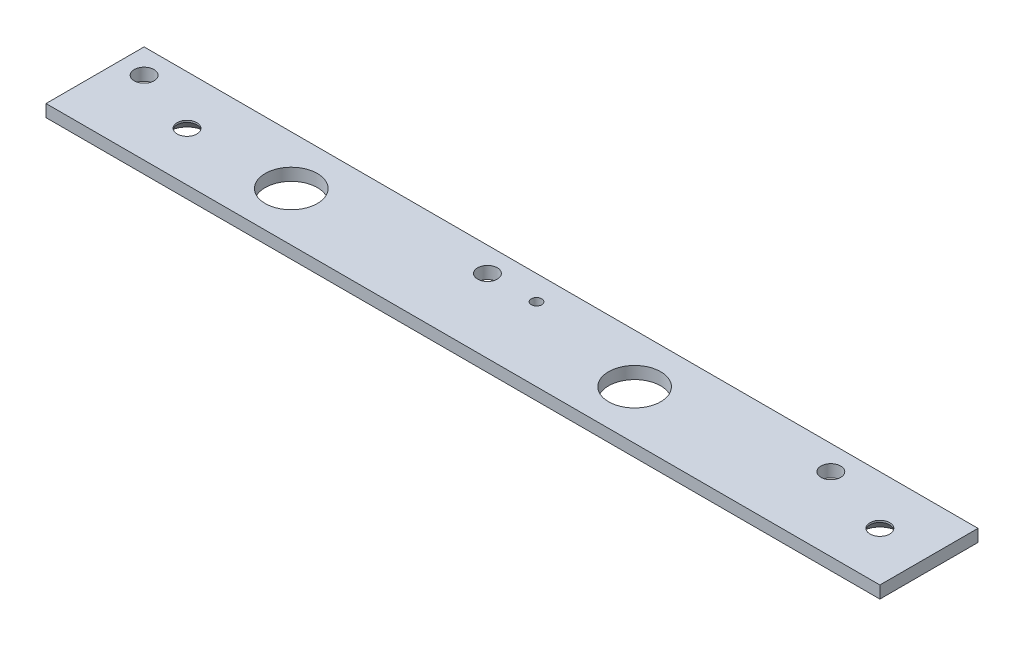
ISO-10303-21;
HEADER;
FILE_DESCRIPTION(('STEP AP214'),'2;1');
FILE_NAME('part.step','',(''),(''),'','','');
FILE_SCHEMA(('AUTOMOTIVE_DESIGN { 1 0 10303 214 1 1 1 1 }'));
ENDSEC;
DATA;
#1=APPLICATION_CONTEXT('core data for automotive mechanical design processes');
#2=APPLICATION_PROTOCOL_DEFINITION('international standard','automotive_design',2000,#1);
#3=PRODUCT_CONTEXT('',#1,'mechanical');
#4=PRODUCT('Part','Part','',(#3));
#5=PRODUCT_RELATED_PRODUCT_CATEGORY('part','',(#4));
#6=PRODUCT_DEFINITION_FORMATION('','',#4);
#7=PRODUCT_DEFINITION_CONTEXT('part definition',#1,'design');
#8=PRODUCT_DEFINITION('design','',#6,#7);
#9=PRODUCT_DEFINITION_SHAPE('','',#8);
#10=(LENGTH_UNIT() NAMED_UNIT(*) SI_UNIT(.MILLI.,.METRE.));
#11=(NAMED_UNIT(*) PLANE_ANGLE_UNIT() SI_UNIT($,.RADIAN.));
#12=(NAMED_UNIT(*) SI_UNIT($,.STERADIAN.) SOLID_ANGLE_UNIT());
#13=UNCERTAINTY_MEASURE_WITH_UNIT(LENGTH_MEASURE(1.E-05),#10,'distance_accuracy_value','');
#14=(GEOMETRIC_REPRESENTATION_CONTEXT(3) GLOBAL_UNCERTAINTY_ASSIGNED_CONTEXT((#13)) GLOBAL_UNIT_ASSIGNED_CONTEXT((#10,
#11,#12)) REPRESENTATION_CONTEXT('',''));
#15=CARTESIAN_POINT('',(0.,0.,0.));
#16=DIRECTION('',(0.,0.,1.));
#17=DIRECTION('',(1.,0.,0.));
#18=AXIS2_PLACEMENT_3D('',#15,#16,#17);
#19=CARTESIAN_POINT('',(107.95,1.5875,-12.7));
#20=DIRECTION('',(0.,0.,1.));
#21=DIRECTION('',(1.,0.,0.));
#22=AXIS2_PLACEMENT_3D('',#19,#20,#21);
#23=PLANE('',#22);
#24=DIRECTION('',(0.,1.,0.));
#25=VECTOR('',#24,1.);
#26=CARTESIAN_POINT('',(-107.95,1.5875,-12.7));
#27=LINE('',#26,#25);
#28=CARTESIAN_POINT('',(-107.95,-1.5875,-12.7));
#29=VERTEX_POINT('',#28);
#30=CARTESIAN_POINT('',(-107.95,1.5875,-12.7));
#31=VERTEX_POINT('',#30);
#32=EDGE_CURVE('E109',#29,#31,#27,.T.);
#33=ORIENTED_EDGE('',*,*,#32,.T.);
#34=DIRECTION('',(-1.,0.,0.));
#35=VECTOR('',#34,1.);
#36=CARTESIAN_POINT('',(107.95,1.5875,-12.7));
#37=LINE('',#36,#35);
#38=CARTESIAN_POINT('',(107.95,1.5875,-12.7));
#39=VERTEX_POINT('',#38);
#40=EDGE_CURVE('E13',#39,#31,#37,.T.);
#41=ORIENTED_EDGE('',*,*,#40,.F.);
#42=DIRECTION('',(0.,1.,0.));
#43=VECTOR('',#42,1.);
#44=CARTESIAN_POINT('',(107.95,1.5875,-12.7));
#45=LINE('',#44,#43);
#46=CARTESIAN_POINT('',(107.95,-1.5875,-12.7));
#47=VERTEX_POINT('',#46);
#48=EDGE_CURVE('E97',#47,#39,#45,.T.);
#49=ORIENTED_EDGE('',*,*,#48,.F.);
#50=DIRECTION('',(-1.,0.,0.));
#51=VECTOR('',#50,1.);
#52=CARTESIAN_POINT('',(107.95,-1.5875,-12.7));
#53=LINE('',#52,#51);
#54=EDGE_CURVE('E105',#47,#29,#53,.T.);
#55=ORIENTED_EDGE('',*,*,#54,.T.);
#56=EDGE_LOOP('',(#33,#41,#49,#55));
#57=FACE_BOUND('',#56,.T.);
#58=ADVANCED_FACE('F46',(#57),#23,.F.);
#59=CARTESIAN_POINT('',(107.95,1.5875,12.7));
#60=DIRECTION('',(0.,-1.,0.));
#61=DIRECTION('',(0.,0.,-1.));
#62=AXIS2_PLACEMENT_3D('',#59,#60,#61);
#63=PLANE('',#62);
#64=CARTESIAN_POINT('',(95.2499999999999,1.5875,1.17961196366423E-13));
#65=DIRECTION('',(0.,-1.,0.));
#66=DIRECTION('',(0.,0.,-1.));
#67=AXIS2_PLACEMENT_3D('',#64,#65,#66);
#68=CIRCLE('',#67,2.55269999999999);
#69=CARTESIAN_POINT('',(95.2499999999999,1.5875,-2.55269999999987));
#70=VERTEX_POINT('',#69);
#71=EDGE_CURVE('E167',#70,#70,#68,.T.);
#72=ORIENTED_EDGE('',*,*,#71,.T.);
#73=EDGE_LOOP('',(#72));
#74=FACE_BOUND('',#73,.T.);
#75=CARTESIAN_POINT('',(-84.1375,1.5875,1.04083408558608E-13));
#76=DIRECTION('',(0.,-1.,0.));
#77=DIRECTION('',(0.,0.,-1.));
#78=AXIS2_PLACEMENT_3D('',#75,#76,#77);
#79=CIRCLE('',#78,2.55269999999999);
#80=CARTESIAN_POINT('',(-84.1375,1.5875,-2.55269999999989));
#81=VERTEX_POINT('',#80);
#82=EDGE_CURVE('E158',#81,#81,#79,.T.);
#83=ORIENTED_EDGE('',*,*,#82,.T.);
#84=EDGE_LOOP('',(#83));
#85=FACE_BOUND('',#84,.T.);
#86=CARTESIAN_POINT('',(0.,1.5875,-6.35));
#87=DIRECTION('',(0.,1.,0.));
#88=DIRECTION('',(0.,0.,1.));
#89=AXIS2_PLACEMENT_3D('',#86,#87,#88);
#90=CIRCLE('',#89,1.35254999999999);
#91=CARTESIAN_POINT('',(0.,1.5875,-4.99745000000001));
#92=VERTEX_POINT('',#91);
#93=EDGE_CURVE('E155',#92,#92,#90,.T.);
#94=ORIENTED_EDGE('',*,*,#93,.F.);
#95=EDGE_LOOP('',(#94));
#96=FACE_BOUND('',#95,.T.);
#97=CARTESIAN_POINT('',(-57.15,1.5875,0.));
#98=DIRECTION('',(0.,1.,0.));
#99=DIRECTION('',(0.,0.,1.));
#100=AXIS2_PLACEMENT_3D('',#97,#98,#99);
#101=CIRCLE('',#100,6.74624);
#102=CARTESIAN_POINT('',(-57.15,1.5875,6.74624));
#103=VERTEX_POINT('',#102);
#104=EDGE_CURVE('E149',#103,#103,#101,.T.);
#105=ORIENTED_EDGE('',*,*,#104,.F.);
#106=EDGE_LOOP('',(#105));
#107=FACE_BOUND('',#106,.T.);
#108=CARTESIAN_POINT('',(31.75,1.5875,0.));
#109=DIRECTION('',(0.,1.,0.));
#110=DIRECTION('',(0.,0.,1.));
#111=AXIS2_PLACEMENT_3D('',#108,#109,#110);
#112=CIRCLE('',#111,6.74624);
#113=CARTESIAN_POINT('',(31.75,1.5875,6.74624));
#114=VERTEX_POINT('',#113);
#115=EDGE_CURVE('E143',#114,#114,#112,.T.);
#116=ORIENTED_EDGE('',*,*,#115,.F.);
#117=EDGE_LOOP('',(#116));
#118=FACE_BOUND('',#117,.T.);
#119=CARTESIAN_POINT('',(-101.6,1.5875,-6.35));
#120=DIRECTION('',(0.,1.,0.));
#121=DIRECTION('',(0.,0.,1.));
#122=AXIS2_PLACEMENT_3D('',#119,#120,#121);
#123=CIRCLE('',#122,2.55269999999999);
#124=CARTESIAN_POINT('',(-101.6,1.5875,-3.79730000000001));
#125=VERTEX_POINT('',#124);
#126=EDGE_CURVE('E137',#125,#125,#123,.T.);
#127=ORIENTED_EDGE('',*,*,#126,.F.);
#128=EDGE_LOOP('',(#127));
#129=FACE_BOUND('',#128,.T.);
#130=CARTESIAN_POINT('',(-12.7,1.5875,-6.35));
#131=DIRECTION('',(0.,1.,0.));
#132=DIRECTION('',(0.,0.,1.));
#133=AXIS2_PLACEMENT_3D('',#130,#131,#132);
#134=CIRCLE('',#133,2.55269999999999);
#135=CARTESIAN_POINT('',(-12.7,1.5875,-3.79730000000001));
#136=VERTEX_POINT('',#135);
#137=EDGE_CURVE('E131',#136,#136,#134,.T.);
#138=ORIENTED_EDGE('',*,*,#137,.F.);
#139=EDGE_LOOP('',(#138));
#140=FACE_BOUND('',#139,.T.);
#141=CARTESIAN_POINT('',(76.2,1.5875,-6.35));
#142=DIRECTION('',(0.,1.,0.));
#143=DIRECTION('',(0.,0.,1.));
#144=AXIS2_PLACEMENT_3D('',#141,#142,#143);
#145=CIRCLE('',#144,2.55269999999999);
#146=CARTESIAN_POINT('',(76.2,1.5875,-3.79730000000001));
#147=VERTEX_POINT('',#146);
#148=EDGE_CURVE('E125',#147,#147,#145,.T.);
#149=ORIENTED_EDGE('',*,*,#148,.F.);
#150=EDGE_LOOP('',(#149));
#151=FACE_BOUND('',#150,.T.);
#152=DIRECTION('',(0.,0.,1.));
#153=VECTOR('',#152,1.);
#154=CARTESIAN_POINT('',(-107.95,1.5875,12.7));
#155=LINE('',#154,#153);
#156=CARTESIAN_POINT('',(-107.95,1.5875,12.7));
#157=VERTEX_POINT('',#156);
#158=EDGE_CURVE('E101',#31,#157,#155,.T.);
#159=ORIENTED_EDGE('',*,*,#158,.T.);
#160=DIRECTION('',(-1.,0.,0.));
#161=VECTOR('',#160,1.);
#162=CARTESIAN_POINT('',(107.95,1.5875,12.7));
#163=LINE('',#162,#161);
#164=CARTESIAN_POINT('',(107.95,1.5875,12.7));
#165=VERTEX_POINT('',#164);
#166=EDGE_CURVE('E54',#165,#157,#163,.T.);
#167=ORIENTED_EDGE('',*,*,#166,.F.);
#168=DIRECTION('',(0.,0.,1.));
#169=VECTOR('',#168,1.);
#170=CARTESIAN_POINT('',(107.95,1.5875,12.7));
#171=LINE('',#170,#169);
#172=EDGE_CURVE('E92',#39,#165,#171,.T.);
#173=ORIENTED_EDGE('',*,*,#172,.F.);
#174=ORIENTED_EDGE('',*,*,#40,.T.);
#175=EDGE_LOOP('',(#159,#167,#173,#174));
#176=FACE_BOUND('',#175,.T.);
#177=ADVANCED_FACE('F100',(#74,#85,#96,#107,#118,#129,#140,#151,#176),#63,.F.);
#178=CARTESIAN_POINT('',(107.95,1.5875,12.7));
#179=DIRECTION('',(0.,0.,-1.));
#180=DIRECTION('',(0.,1.,0.));
#181=AXIS2_PLACEMENT_3D('',#178,#179,#180);
#182=PLANE('',#181);
#183=DIRECTION('',(0.,-1.,0.));
#184=VECTOR('',#183,1.);
#185=CARTESIAN_POINT('',(-107.95,1.5875,12.7));
#186=LINE('',#185,#184);
#187=CARTESIAN_POINT('',(-107.95,-1.5875,12.7));
#188=VERTEX_POINT('',#187);
#189=EDGE_CURVE('E79',#157,#188,#186,.T.);
#190=ORIENTED_EDGE('',*,*,#189,.T.);
#191=DIRECTION('',(-1.,0.,0.));
#192=VECTOR('',#191,1.);
#193=CARTESIAN_POINT('',(107.95,-1.5875,12.7));
#194=LINE('',#193,#192);
#195=CARTESIAN_POINT('',(107.95,-1.5875,12.7));
#196=VERTEX_POINT('',#195);
#197=EDGE_CURVE('E102',#196,#188,#194,.T.);
#198=ORIENTED_EDGE('',*,*,#197,.F.);
#199=DIRECTION('',(0.,-1.,0.));
#200=VECTOR('',#199,1.);
#201=CARTESIAN_POINT('',(107.95,1.5875,12.7));
#202=LINE('',#201,#200);
#203=EDGE_CURVE('E95',#165,#196,#202,.T.);
#204=ORIENTED_EDGE('',*,*,#203,.F.);
#205=ORIENTED_EDGE('',*,*,#166,.T.);
#206=EDGE_LOOP('',(#190,#198,#204,#205));
#207=FACE_BOUND('',#206,.T.);
#208=ADVANCED_FACE('F103',(#207),#182,.F.);
#209=CARTESIAN_POINT('',(107.95,-1.5875,12.7));
#210=DIRECTION('',(0.,1.,0.));
#211=DIRECTION('',(0.,0.,1.));
#212=AXIS2_PLACEMENT_3D('',#209,#210,#211);
#213=PLANE('',#212);
#214=CARTESIAN_POINT('',(95.2499999999999,-1.5875,1.17961196366423E-13));
#215=DIRECTION('',(0.,-1.,0.));
#216=DIRECTION('',(0.,0.,-1.));
#217=AXIS2_PLACEMENT_3D('',#214,#215,#216);
#218=CIRCLE('',#217,4.88950000000001);
#219=CARTESIAN_POINT('',(95.2499999999999,-1.5875,-4.88949999999989));
#220=VERTEX_POINT('',#219);
#221=EDGE_CURVE('E173',#220,#220,#218,.T.);
#222=ORIENTED_EDGE('',*,*,#221,.F.);
#223=EDGE_LOOP('',(#222));
#224=FACE_BOUND('',#223,.T.);
#225=CARTESIAN_POINT('',(-84.1375,-1.5875,1.04083408558608E-13));
#226=DIRECTION('',(0.,-1.,0.));
#227=DIRECTION('',(0.,0.,-1.));
#228=AXIS2_PLACEMENT_3D('',#225,#226,#227);
#229=CIRCLE('',#228,4.88950000000001);
#230=CARTESIAN_POINT('',(-84.1375,-1.5875,-4.8894999999999));
#231=VERTEX_POINT('',#230);
#232=EDGE_CURVE('E164',#231,#231,#229,.T.);
#233=ORIENTED_EDGE('',*,*,#232,.F.);
#234=EDGE_LOOP('',(#233));
#235=FACE_BOUND('',#234,.T.);
#236=CARTESIAN_POINT('',(0.,-1.5875,-6.35));
#237=DIRECTION('',(0.,1.,0.));
#238=DIRECTION('',(0.,0.,1.));
#239=AXIS2_PLACEMENT_3D('',#236,#237,#238);
#240=CIRCLE('',#239,1.35255);
#241=CARTESIAN_POINT('',(0.,-1.5875,-4.99745));
#242=VERTEX_POINT('',#241);
#243=EDGE_CURVE('E152',#242,#242,#240,.T.);
#244=ORIENTED_EDGE('',*,*,#243,.T.);
#245=EDGE_LOOP('',(#244));
#246=FACE_BOUND('',#245,.T.);
#247=CARTESIAN_POINT('',(-57.15,-1.5875,0.));
#248=DIRECTION('',(0.,1.,0.));
#249=DIRECTION('',(0.,0.,1.));
#250=AXIS2_PLACEMENT_3D('',#247,#248,#249);
#251=CIRCLE('',#250,6.74624);
#252=CARTESIAN_POINT('',(-57.15,-1.5875,6.74624));
#253=VERTEX_POINT('',#252);
#254=EDGE_CURVE('E146',#253,#253,#251,.T.);
#255=ORIENTED_EDGE('',*,*,#254,.T.);
#256=EDGE_LOOP('',(#255));
#257=FACE_BOUND('',#256,.T.);
#258=CARTESIAN_POINT('',(31.75,-1.5875,0.));
#259=DIRECTION('',(0.,1.,0.));
#260=DIRECTION('',(0.,0.,1.));
#261=AXIS2_PLACEMENT_3D('',#258,#259,#260);
#262=CIRCLE('',#261,6.74624);
#263=CARTESIAN_POINT('',(31.75,-1.5875,6.74624));
#264=VERTEX_POINT('',#263);
#265=EDGE_CURVE('E140',#264,#264,#262,.T.);
#266=ORIENTED_EDGE('',*,*,#265,.T.);
#267=EDGE_LOOP('',(#266));
#268=FACE_BOUND('',#267,.T.);
#269=CARTESIAN_POINT('',(-101.6,-1.5875,-6.35));
#270=DIRECTION('',(0.,1.,0.));
#271=DIRECTION('',(0.,0.,1.));
#272=AXIS2_PLACEMENT_3D('',#269,#270,#271);
#273=CIRCLE('',#272,2.55270000000001);
#274=CARTESIAN_POINT('',(-101.6,-1.5875,-3.79729999999999));
#275=VERTEX_POINT('',#274);
#276=EDGE_CURVE('E134',#275,#275,#273,.T.);
#277=ORIENTED_EDGE('',*,*,#276,.T.);
#278=EDGE_LOOP('',(#277));
#279=FACE_BOUND('',#278,.T.);
#280=CARTESIAN_POINT('',(-12.7,-1.5875,-6.35));
#281=DIRECTION('',(0.,1.,0.));
#282=DIRECTION('',(0.,0.,1.));
#283=AXIS2_PLACEMENT_3D('',#280,#281,#282);
#284=CIRCLE('',#283,2.5527);
#285=CARTESIAN_POINT('',(-12.7,-1.5875,-3.7973));
#286=VERTEX_POINT('',#285);
#287=EDGE_CURVE('E128',#286,#286,#284,.T.);
#288=ORIENTED_EDGE('',*,*,#287,.T.);
#289=EDGE_LOOP('',(#288));
#290=FACE_BOUND('',#289,.T.);
#291=CARTESIAN_POINT('',(76.2,-1.5875,-6.35));
#292=DIRECTION('',(0.,1.,0.));
#293=DIRECTION('',(0.,0.,1.));
#294=AXIS2_PLACEMENT_3D('',#291,#292,#293);
#295=CIRCLE('',#294,2.55270000000001);
#296=CARTESIAN_POINT('',(76.2,-1.5875,-3.79729999999999));
#297=VERTEX_POINT('',#296);
#298=EDGE_CURVE('E112',#297,#297,#295,.T.);
#299=ORIENTED_EDGE('',*,*,#298,.T.);
#300=EDGE_LOOP('',(#299));
#301=FACE_BOUND('',#300,.T.);
#302=DIRECTION('',(0.,0.,-1.));
#303=VECTOR('',#302,1.);
#304=CARTESIAN_POINT('',(-107.95,-1.5875,12.7));
#305=LINE('',#304,#303);
#306=EDGE_CURVE('E85',#188,#29,#305,.T.);
#307=ORIENTED_EDGE('',*,*,#306,.T.);
#308=ORIENTED_EDGE('',*,*,#54,.F.);
#309=DIRECTION('',(0.,0.,-1.));
#310=VECTOR('',#309,1.);
#311=CARTESIAN_POINT('',(107.95,-1.5875,12.7));
#312=LINE('',#311,#310);
#313=EDGE_CURVE('E62',#196,#47,#312,.T.);
#314=ORIENTED_EDGE('',*,*,#313,.F.);
#315=ORIENTED_EDGE('',*,*,#197,.T.);
#316=EDGE_LOOP('',(#307,#308,#314,#315));
#317=FACE_BOUND('',#316,.T.);
#318=ADVANCED_FACE('F117',(#224,#235,#246,#257,#268,#279,#290,#301,#317),#213,.F.);
#319=CARTESIAN_POINT('',(107.95,0.,0.));
#320=DIRECTION('',(1.,0.,0.));
#321=DIRECTION('',(0.,0.,-1.));
#322=AXIS2_PLACEMENT_3D('',#319,#320,#321);
#323=PLANE('',#322);
#324=ORIENTED_EDGE('',*,*,#48,.T.);
#325=ORIENTED_EDGE('',*,*,#172,.T.);
#326=ORIENTED_EDGE('',*,*,#203,.T.);
#327=ORIENTED_EDGE('',*,*,#313,.T.);
#328=EDGE_LOOP('',(#324,#325,#326,#327));
#329=FACE_BOUND('',#328,.T.);
#330=ADVANCED_FACE('F93',(#329),#323,.T.);
#331=CARTESIAN_POINT('',(-107.95,0.,0.));
#332=DIRECTION('',(1.,0.,0.));
#333=DIRECTION('',(0.,0.,-1.));
#334=AXIS2_PLACEMENT_3D('',#331,#332,#333);
#335=PLANE('',#334);
#336=ORIENTED_EDGE('',*,*,#32,.F.);
#337=ORIENTED_EDGE('',*,*,#306,.F.);
#338=ORIENTED_EDGE('',*,*,#189,.F.);
#339=ORIENTED_EDGE('',*,*,#158,.F.);
#340=EDGE_LOOP('',(#336,#337,#338,#339));
#341=FACE_BOUND('',#340,.T.);
#342=ADVANCED_FACE('F120',(#341),#335,.F.);
#343=CARTESIAN_POINT('',(76.2,1.5875,-6.35));
#344=DIRECTION('',(0.,1.,0.));
#345=DIRECTION('',(0.,0.,1.));
#346=AXIS2_PLACEMENT_3D('',#343,#344,#345);
#347=CYLINDRICAL_SURFACE('',#346,2.5527);
#348=ORIENTED_EDGE('',*,*,#298,.F.);
#349=EDGE_LOOP('',(#348));
#350=FACE_BOUND('',#349,.T.);
#351=ORIENTED_EDGE('',*,*,#148,.T.);
#352=EDGE_LOOP('',(#351));
#353=FACE_BOUND('',#352,.T.);
#354=ADVANCED_FACE('F196',(#350,#353),#347,.F.);
#355=CARTESIAN_POINT('',(-12.7,1.5875,-6.35));
#356=DIRECTION('',(0.,1.,0.));
#357=DIRECTION('',(0.,0.,1.));
#358=AXIS2_PLACEMENT_3D('',#355,#356,#357);
#359=CYLINDRICAL_SURFACE('',#358,2.55269999999999);
#360=ORIENTED_EDGE('',*,*,#287,.F.);
#361=EDGE_LOOP('',(#360));
#362=FACE_BOUND('',#361,.T.);
#363=ORIENTED_EDGE('',*,*,#137,.T.);
#364=EDGE_LOOP('',(#363));
#365=FACE_BOUND('',#364,.T.);
#366=ADVANCED_FACE('F199',(#362,#365),#359,.F.);
#367=CARTESIAN_POINT('',(-101.6,1.5875,-6.35));
#368=DIRECTION('',(0.,1.,0.));
#369=DIRECTION('',(0.,0.,1.));
#370=AXIS2_PLACEMENT_3D('',#367,#368,#369);
#371=CYLINDRICAL_SURFACE('',#370,2.5527);
#372=ORIENTED_EDGE('',*,*,#276,.F.);
#373=EDGE_LOOP('',(#372));
#374=FACE_BOUND('',#373,.T.);
#375=ORIENTED_EDGE('',*,*,#126,.T.);
#376=EDGE_LOOP('',(#375));
#377=FACE_BOUND('',#376,.T.);
#378=ADVANCED_FACE('F219',(#374,#377),#371,.F.);
#379=CARTESIAN_POINT('',(31.75,1.5875,0.));
#380=DIRECTION('',(0.,1.,0.));
#381=DIRECTION('',(0.,0.,1.));
#382=AXIS2_PLACEMENT_3D('',#379,#380,#381);
#383=CYLINDRICAL_SURFACE('',#382,6.74624);
#384=ORIENTED_EDGE('',*,*,#265,.F.);
#385=EDGE_LOOP('',(#384));
#386=FACE_BOUND('',#385,.T.);
#387=ORIENTED_EDGE('',*,*,#115,.T.);
#388=EDGE_LOOP('',(#387));
#389=FACE_BOUND('',#388,.T.);
#390=ADVANCED_FACE('F223',(#386,#389),#383,.F.);
#391=CARTESIAN_POINT('',(-57.15,1.5875,0.));
#392=DIRECTION('',(0.,1.,0.));
#393=DIRECTION('',(0.,0.,1.));
#394=AXIS2_PLACEMENT_3D('',#391,#392,#393);
#395=CYLINDRICAL_SURFACE('',#394,6.74624);
#396=ORIENTED_EDGE('',*,*,#254,.F.);
#397=EDGE_LOOP('',(#396));
#398=FACE_BOUND('',#397,.T.);
#399=ORIENTED_EDGE('',*,*,#104,.T.);
#400=EDGE_LOOP('',(#399));
#401=FACE_BOUND('',#400,.T.);
#402=ADVANCED_FACE('F227',(#398,#401),#395,.F.);
#403=CARTESIAN_POINT('',(0.,1.5875,-6.35));
#404=DIRECTION('',(0.,1.,0.));
#405=DIRECTION('',(0.,0.,1.));
#406=AXIS2_PLACEMENT_3D('',#403,#404,#405);
#407=CYLINDRICAL_SURFACE('',#406,1.35254999999999);
#408=ORIENTED_EDGE('',*,*,#243,.F.);
#409=EDGE_LOOP('',(#408));
#410=FACE_BOUND('',#409,.T.);
#411=ORIENTED_EDGE('',*,*,#93,.T.);
#412=EDGE_LOOP('',(#411));
#413=FACE_BOUND('',#412,.T.);
#414=ADVANCED_FACE('F231',(#410,#413),#407,.F.);
#415=CARTESIAN_POINT('',(-84.1375,-1.5875,1.04083408558608E-13));
#416=DIRECTION('',(0.,-1.,0.));
#417=DIRECTION('',(0.,0.,-1.));
#418=AXIS2_PLACEMENT_3D('',#415,#416,#417);
#419=CYLINDRICAL_SURFACE('',#418,2.5527);
#420=ORIENTED_EDGE('',*,*,#82,.F.);
#421=EDGE_LOOP('',(#420));
#422=FACE_BOUND('',#421,.T.);
#423=CARTESIAN_POINT('',(-84.1375,1.10068089399406,1.04083408558608E-13));
#424=DIRECTION('',(0.,-1.,0.));
#425=DIRECTION('',(0.,0.,-1.));
#426=AXIS2_PLACEMENT_3D('',#423,#424,#425);
#427=CIRCLE('',#426,2.55270000000001);
#428=CARTESIAN_POINT('',(-84.1375,1.10068089399406,-2.5526999999999));
#429=VERTEX_POINT('',#428);
#430=EDGE_CURVE('E161',#429,#429,#427,.T.);
#431=ORIENTED_EDGE('',*,*,#430,.T.);
#432=EDGE_LOOP('',(#431));
#433=FACE_BOUND('',#432,.T.);
#434=ADVANCED_FACE('F235',(#422,#433),#419,.F.);
#435=CARTESIAN_POINT('',(-84.1375,-1.5875,1.04083408558608E-13));
#436=DIRECTION('',(0.,-1.,0.));
#437=DIRECTION('',(0.,0.,-1.));
#438=AXIS2_PLACEMENT_3D('',#435,#436,#437);
#439=CONICAL_SURFACE('',#438,4.88950000000001,0.715584993317675);
#440=ORIENTED_EDGE('',*,*,#430,.F.);
#441=EDGE_LOOP('',(#440));
#442=FACE_BOUND('',#441,.T.);
#443=ORIENTED_EDGE('',*,*,#232,.T.);
#444=EDGE_LOOP('',(#443));
#445=FACE_BOUND('',#444,.T.);
#446=ADVANCED_FACE('F239',(#442,#445),#439,.F.);
#447=CARTESIAN_POINT('',(95.2499999999999,-1.5875,1.17961196366423E-13));
#448=DIRECTION('',(0.,-1.,0.));
#449=DIRECTION('',(0.,0.,-1.));
#450=AXIS2_PLACEMENT_3D('',#447,#448,#449);
#451=CYLINDRICAL_SURFACE('',#450,2.5527);
#452=ORIENTED_EDGE('',*,*,#71,.F.);
#453=EDGE_LOOP('',(#452));
#454=FACE_BOUND('',#453,.T.);
#455=CARTESIAN_POINT('',(95.2499999999999,1.10068089399406,1.17961196366423E-13));
#456=DIRECTION('',(0.,-1.,0.));
#457=DIRECTION('',(0.,0.,-1.));
#458=AXIS2_PLACEMENT_3D('',#455,#456,#457);
#459=CIRCLE('',#458,2.55270000000001);
#460=CARTESIAN_POINT('',(95.2499999999999,1.10068089399406,-2.55269999999989));
#461=VERTEX_POINT('',#460);
#462=EDGE_CURVE('E170',#461,#461,#459,.T.);
#463=ORIENTED_EDGE('',*,*,#462,.T.);
#464=EDGE_LOOP('',(#463));
#465=FACE_BOUND('',#464,.T.);
#466=ADVANCED_FACE('F243',(#454,#465),#451,.F.);
#467=CARTESIAN_POINT('',(95.2499999999999,-1.5875,1.17961196366423E-13));
#468=DIRECTION('',(0.,-1.,0.));
#469=DIRECTION('',(0.,0.,-1.));
#470=AXIS2_PLACEMENT_3D('',#467,#468,#469);
#471=CONICAL_SURFACE('',#470,4.88950000000001,0.715584993317675);
#472=ORIENTED_EDGE('',*,*,#462,.F.);
#473=EDGE_LOOP('',(#472));
#474=FACE_BOUND('',#473,.T.);
#475=ORIENTED_EDGE('',*,*,#221,.T.);
#476=EDGE_LOOP('',(#475));
#477=FACE_BOUND('',#476,.T.);
#478=ADVANCED_FACE('F177',(#474,#477),#471,.F.);
#479=CLOSED_SHELL('',(#58,#177,#208,#318,#330,#342,#354,#366,#378,#390,#402,#414,#434,#446,#466,#478));
#480=MANIFOLD_SOLID_BREP('B2',#479);
#481=ADVANCED_BREP_SHAPE_REPRESENTATION('',(#18,#480),#14);
#482=SHAPE_DEFINITION_REPRESENTATION(#9,#481);
ENDSEC;
END-ISO-10303-21;
